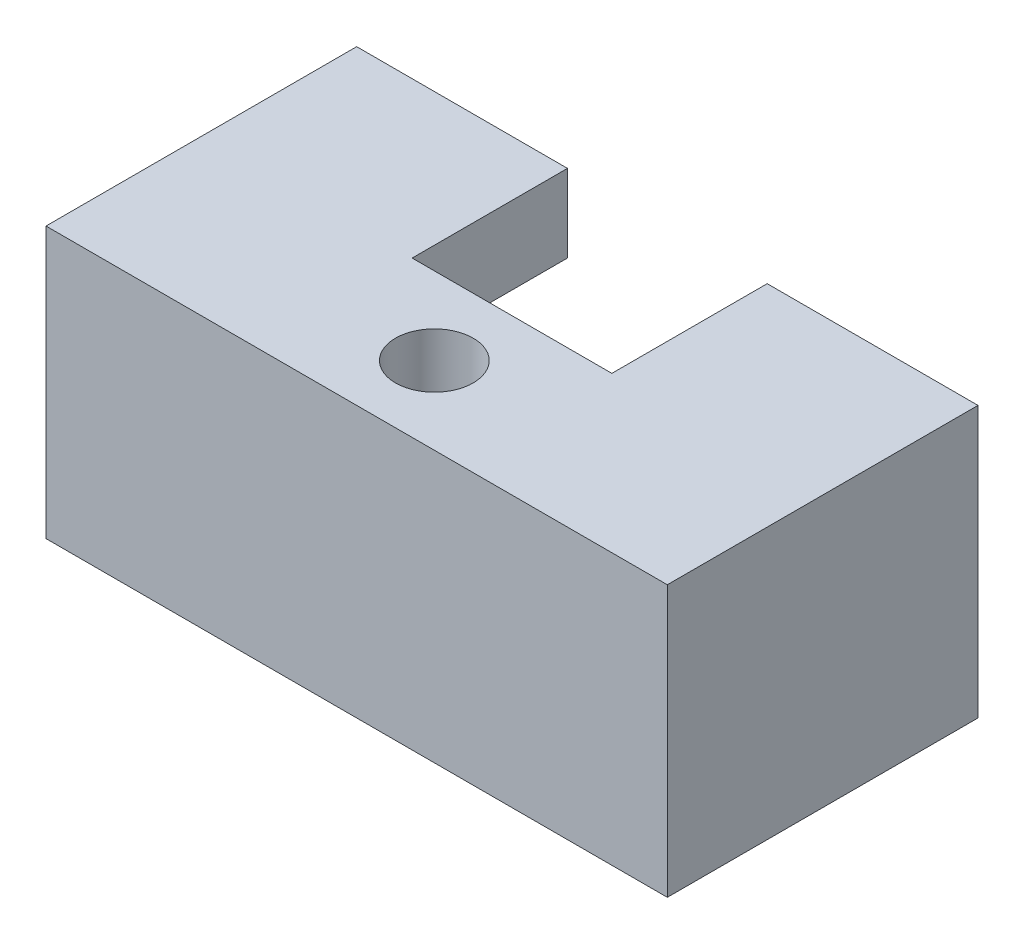
ISO-10303-21;
HEADER;
FILE_DESCRIPTION(('STEP AP214'),'2;1');
FILE_NAME('part.step','',(''),(''),'','','');
FILE_SCHEMA(('AUTOMOTIVE_DESIGN { 1 0 10303 214 1 1 1 1 }'));
ENDSEC;
DATA;
#1=APPLICATION_CONTEXT('core data for automotive mechanical design processes');
#2=APPLICATION_PROTOCOL_DEFINITION('international standard','automotive_design',2000,#1);
#3=PRODUCT_CONTEXT('',#1,'mechanical');
#4=PRODUCT('Part','Part','',(#3));
#5=PRODUCT_RELATED_PRODUCT_CATEGORY('part','',(#4));
#6=PRODUCT_DEFINITION_FORMATION('','',#4);
#7=PRODUCT_DEFINITION_CONTEXT('part definition',#1,'design');
#8=PRODUCT_DEFINITION('design','',#6,#7);
#9=PRODUCT_DEFINITION_SHAPE('','',#8);
#10=(LENGTH_UNIT() NAMED_UNIT(*) SI_UNIT(.MILLI.,.METRE.));
#11=(NAMED_UNIT(*) PLANE_ANGLE_UNIT() SI_UNIT($,.RADIAN.));
#12=(NAMED_UNIT(*) SI_UNIT($,.STERADIAN.) SOLID_ANGLE_UNIT());
#13=UNCERTAINTY_MEASURE_WITH_UNIT(LENGTH_MEASURE(1.E-05),#10,'distance_accuracy_value','');
#14=(GEOMETRIC_REPRESENTATION_CONTEXT(3) GLOBAL_UNCERTAINTY_ASSIGNED_CONTEXT((#13)) GLOBAL_UNIT_ASSIGNED_CONTEXT((#10,
#11,#12)) REPRESENTATION_CONTEXT('',''));
#15=CARTESIAN_POINT('',(0.,0.,0.));
#16=DIRECTION('',(0.,0.,1.));
#17=DIRECTION('',(1.,0.,0.));
#18=AXIS2_PLACEMENT_3D('',#15,#16,#17);
#19=CARTESIAN_POINT('',(9.25,8.7,0.));
#20=DIRECTION('',(-1.,0.,0.));
#21=DIRECTION('',(0.,0.,1.));
#22=AXIS2_PLACEMENT_3D('',#19,#20,#21);
#23=PLANE('',#22);
#24=DIRECTION('',(0.,0.,-1.));
#25=VECTOR('',#24,1.);
#26=CARTESIAN_POINT('',(9.25,0.,0.));
#27=LINE('',#26,#25);
#28=CARTESIAN_POINT('',(9.25,0.,0.));
#29=VERTEX_POINT('',#28);
#30=CARTESIAN_POINT('',(9.25,0.,-7.));
#31=VERTEX_POINT('',#30);
#32=EDGE_CURVE('E140',#29,#31,#27,.T.);
#33=ORIENTED_EDGE('',*,*,#32,.F.);
#34=DIRECTION('',(0.,-1.,0.));
#35=VECTOR('',#34,1.);
#36=CARTESIAN_POINT('',(9.25,8.7,0.));
#37=LINE('',#36,#35);
#38=CARTESIAN_POINT('',(9.25,8.7,0.));
#39=VERTEX_POINT('',#38);
#40=EDGE_CURVE('E12',#39,#29,#37,.T.);
#41=ORIENTED_EDGE('',*,*,#40,.F.);
#42=DIRECTION('',(0.,0.,-1.));
#43=VECTOR('',#42,1.);
#44=CARTESIAN_POINT('',(9.25,8.7,0.));
#45=LINE('',#44,#43);
#46=CARTESIAN_POINT('',(9.25,8.7,-7.));
#47=VERTEX_POINT('',#46);
#48=EDGE_CURVE('E141',#39,#47,#45,.T.);
#49=ORIENTED_EDGE('',*,*,#48,.T.);
#50=DIRECTION('',(0.,-1.,0.));
#51=VECTOR('',#50,1.);
#52=CARTESIAN_POINT('',(9.25,8.7,-7.));
#53=LINE('',#52,#51);
#54=EDGE_CURVE('E125',#47,#31,#53,.T.);
#55=ORIENTED_EDGE('',*,*,#54,.T.);
#56=EDGE_LOOP('',(#33,#41,#49,#55));
#57=FACE_BOUND('',#56,.T.);
#58=ADVANCED_FACE('F66',(#57),#23,.T.);
#59=CARTESIAN_POINT('',(0.,8.7,0.));
#60=DIRECTION('',(0.,0.,-1.));
#61=DIRECTION('',(-1.,0.,0.));
#62=AXIS2_PLACEMENT_3D('',#59,#60,#61);
#63=PLANE('',#62);
#64=DIRECTION('',(1.,0.,0.));
#65=VECTOR('',#64,1.);
#66=CARTESIAN_POINT('',(0.,0.,0.));
#67=LINE('',#66,#65);
#68=CARTESIAN_POINT('',(-9.25,0.,0.));
#69=VERTEX_POINT('',#68);
#70=EDGE_CURVE('E166',#69,#29,#67,.T.);
#71=ORIENTED_EDGE('',*,*,#70,.F.);
#72=DIRECTION('',(0.,-1.,0.));
#73=VECTOR('',#72,1.);
#74=CARTESIAN_POINT('',(-9.25,8.7,0.));
#75=LINE('',#74,#73);
#76=CARTESIAN_POINT('',(-9.25,8.7,0.));
#77=VERTEX_POINT('',#76);
#78=EDGE_CURVE('E75',#77,#69,#75,.T.);
#79=ORIENTED_EDGE('',*,*,#78,.F.);
#80=DIRECTION('',(1.,0.,0.));
#81=VECTOR('',#80,1.);
#82=CARTESIAN_POINT('',(0.,8.7,0.));
#83=LINE('',#82,#81);
#84=CARTESIAN_POINT('',(-4.5,8.7,0.));
#85=VERTEX_POINT('',#84);
#86=EDGE_CURVE('E82',#77,#85,#83,.T.);
#87=ORIENTED_EDGE('',*,*,#86,.T.);
#88=DIRECTION('',(0.,-1.,0.));
#89=VECTOR('',#88,1.);
#90=CARTESIAN_POINT('',(-4.5,12.2,0.));
#91=LINE('',#90,#89);
#92=CARTESIAN_POINT('',(-4.5,12.2,0.));
#93=VERTEX_POINT('',#92);
#94=EDGE_CURVE('E271',#93,#85,#91,.T.);
#95=ORIENTED_EDGE('',*,*,#94,.F.);
#96=DIRECTION('',(-1.,0.,0.));
#97=VECTOR('',#96,1.);
#98=CARTESIAN_POINT('',(0.,12.2,0.));
#99=LINE('',#98,#97);
#100=CARTESIAN_POINT('',(4.5,12.2,0.));
#101=VERTEX_POINT('',#100);
#102=EDGE_CURVE('E254',#101,#93,#99,.T.);
#103=ORIENTED_EDGE('',*,*,#102,.F.);
#104=DIRECTION('',(0.,-1.,0.));
#105=VECTOR('',#104,1.);
#106=CARTESIAN_POINT('',(4.5,12.2,0.));
#107=LINE('',#106,#105);
#108=CARTESIAN_POINT('',(4.5,8.7,0.));
#109=VERTEX_POINT('',#108);
#110=EDGE_CURVE('E249',#101,#109,#107,.T.);
#111=ORIENTED_EDGE('',*,*,#110,.T.);
#112=EDGE_CURVE('E144',#109,#39,#83,.T.);
#113=ORIENTED_EDGE('',*,*,#112,.T.);
#114=ORIENTED_EDGE('',*,*,#40,.T.);
#115=EDGE_LOOP('',(#71,#79,#87,#95,#103,#111,#113,#114));
#116=FACE_BOUND('',#115,.T.);
#117=ADVANCED_FACE('F167',(#116),#63,.T.);
#118=CARTESIAN_POINT('',(-9.25,8.7,0.));
#119=DIRECTION('',(1.,0.,0.));
#120=DIRECTION('',(0.,0.,-1.));
#121=AXIS2_PLACEMENT_3D('',#118,#119,#120);
#122=PLANE('',#121);
#123=DIRECTION('',(0.,0.,1.));
#124=VECTOR('',#123,1.);
#125=CARTESIAN_POINT('',(-9.25,0.,0.));
#126=LINE('',#125,#124);
#127=CARTESIAN_POINT('',(-9.25,0.,-6.99999999999999));
#128=VERTEX_POINT('',#127);
#129=EDGE_CURVE('E163',#128,#69,#126,.T.);
#130=ORIENTED_EDGE('',*,*,#129,.F.);
#131=DIRECTION('',(0.,-1.,0.));
#132=VECTOR('',#131,1.);
#133=CARTESIAN_POINT('',(-9.25,8.7,-6.99999999999999));
#134=LINE('',#133,#132);
#135=CARTESIAN_POINT('',(-9.25,8.7,-6.99999999999999));
#136=VERTEX_POINT('',#135);
#137=EDGE_CURVE('E155',#136,#128,#134,.T.);
#138=ORIENTED_EDGE('',*,*,#137,.F.);
#139=DIRECTION('',(0.,0.,1.));
#140=VECTOR('',#139,1.);
#141=CARTESIAN_POINT('',(-9.25,8.7,0.));
#142=LINE('',#141,#140);
#143=EDGE_CURVE('E148',#136,#77,#142,.T.);
#144=ORIENTED_EDGE('',*,*,#143,.T.);
#145=ORIENTED_EDGE('',*,*,#78,.T.);
#146=EDGE_LOOP('',(#130,#138,#144,#145));
#147=FACE_BOUND('',#146,.T.);
#148=ADVANCED_FACE('F160',(#147),#122,.T.);
#149=CARTESIAN_POINT('',(0.,8.7,-6.99999999999999));
#150=DIRECTION('',(0.,0.,-1.));
#151=DIRECTION('',(-1.,0.,0.));
#152=AXIS2_PLACEMENT_3D('',#149,#150,#151);
#153=PLANE('',#152);
#154=DIRECTION('',(1.,0.,0.));
#155=VECTOR('',#154,1.);
#156=CARTESIAN_POINT('',(0.,0.,-6.99999999999999));
#157=LINE('',#156,#155);
#158=CARTESIAN_POINT('',(-14.,0.,-6.99999999999999));
#159=VERTEX_POINT('',#158);
#160=EDGE_CURVE('E173',#159,#128,#157,.T.);
#161=ORIENTED_EDGE('',*,*,#160,.F.);
#162=DIRECTION('',(0.,-1.,0.));
#163=VECTOR('',#162,1.);
#164=CARTESIAN_POINT('',(-14.,8.7,-6.99999999999999));
#165=LINE('',#164,#163);
#166=CARTESIAN_POINT('',(-14.,12.2,-6.99999999999999));
#167=VERTEX_POINT('',#166);
#168=EDGE_CURVE('E153',#167,#159,#165,.T.);
#169=ORIENTED_EDGE('',*,*,#168,.F.);
#170=DIRECTION('',(-1.,0.,0.));
#171=VECTOR('',#170,1.);
#172=CARTESIAN_POINT('',(0.,12.2,-6.99999999999999));
#173=LINE('',#172,#171);
#174=CARTESIAN_POINT('',(-4.5,12.2,-6.99999999999999));
#175=VERTEX_POINT('',#174);
#176=EDGE_CURVE('E269',#175,#167,#173,.T.);
#177=ORIENTED_EDGE('',*,*,#176,.F.);
#178=DIRECTION('',(0.,-1.,0.));
#179=VECTOR('',#178,1.);
#180=CARTESIAN_POINT('',(-4.5,12.2,-6.99999999999999));
#181=LINE('',#180,#179);
#182=CARTESIAN_POINT('',(-4.5,8.7,-6.99999999999999));
#183=VERTEX_POINT('',#182);
#184=EDGE_CURVE('E261',#175,#183,#181,.T.);
#185=ORIENTED_EDGE('',*,*,#184,.T.);
#186=DIRECTION('',(-1.,0.,0.));
#187=VECTOR('',#186,1.);
#188=CARTESIAN_POINT('',(0.,8.7,-6.99999999999999));
#189=LINE('',#188,#187);
#190=EDGE_CURVE('E203',#183,#136,#189,.T.);
#191=ORIENTED_EDGE('',*,*,#190,.T.);
#192=ORIENTED_EDGE('',*,*,#137,.T.);
#193=EDGE_LOOP('',(#161,#169,#177,#185,#191,#192));
#194=FACE_BOUND('',#193,.T.);
#195=ADVANCED_FACE('F198',(#194),#153,.T.);
#196=CARTESIAN_POINT('',(-14.,8.7,0.));
#197=DIRECTION('',(-1.,0.,0.));
#198=DIRECTION('',(0.,0.,1.));
#199=AXIS2_PLACEMENT_3D('',#196,#197,#198);
#200=PLANE('',#199);
#201=DIRECTION('',(0.,0.,-1.));
#202=VECTOR('',#201,1.);
#203=CARTESIAN_POINT('',(-14.,0.,0.));
#204=LINE('',#203,#202);
#205=CARTESIAN_POINT('',(-14.,0.,7.00000000000001));
#206=VERTEX_POINT('',#205);
#207=EDGE_CURVE('E175',#206,#159,#204,.T.);
#208=ORIENTED_EDGE('',*,*,#207,.F.);
#209=DIRECTION('',(0.,-1.,0.));
#210=VECTOR('',#209,1.);
#211=CARTESIAN_POINT('',(-14.,8.7,7.00000000000001));
#212=LINE('',#211,#210);
#213=CARTESIAN_POINT('',(-14.,12.2,7.00000000000001));
#214=VERTEX_POINT('',#213);
#215=EDGE_CURVE('E151',#214,#206,#212,.T.);
#216=ORIENTED_EDGE('',*,*,#215,.F.);
#217=DIRECTION('',(0.,0.,1.));
#218=VECTOR('',#217,1.);
#219=CARTESIAN_POINT('',(-14.,12.2,0.));
#220=LINE('',#219,#218);
#221=EDGE_CURVE('E194',#167,#214,#220,.T.);
#222=ORIENTED_EDGE('',*,*,#221,.F.);
#223=ORIENTED_EDGE('',*,*,#168,.T.);
#224=EDGE_LOOP('',(#208,#216,#222,#223));
#225=FACE_BOUND('',#224,.T.);
#226=ADVANCED_FACE('F191',(#225),#200,.T.);
#227=CARTESIAN_POINT('',(0.,8.7,7.));
#228=DIRECTION('',(0.,0.,1.));
#229=DIRECTION('',(1.,0.,0.));
#230=AXIS2_PLACEMENT_3D('',#227,#228,#229);
#231=PLANE('',#230);
#232=DIRECTION('',(-1.,0.,0.));
#233=VECTOR('',#232,1.);
#234=CARTESIAN_POINT('',(0.,0.,7.));
#235=LINE('',#234,#233);
#236=CARTESIAN_POINT('',(14.,0.,7.));
#237=VERTEX_POINT('',#236);
#238=EDGE_CURVE('E134',#237,#206,#235,.T.);
#239=ORIENTED_EDGE('',*,*,#238,.F.);
#240=DIRECTION('',(0.,-1.,0.));
#241=VECTOR('',#240,1.);
#242=CARTESIAN_POINT('',(14.,8.7,7.));
#243=LINE('',#242,#241);
#244=CARTESIAN_POINT('',(14.,12.2,7.));
#245=VERTEX_POINT('',#244);
#246=EDGE_CURVE('E124',#245,#237,#243,.T.);
#247=ORIENTED_EDGE('',*,*,#246,.F.);
#248=DIRECTION('',(1.,0.,0.));
#249=VECTOR('',#248,1.);
#250=CARTESIAN_POINT('',(0.,12.2,7.));
#251=LINE('',#250,#249);
#252=EDGE_CURVE('E187',#214,#245,#251,.T.);
#253=ORIENTED_EDGE('',*,*,#252,.F.);
#254=ORIENTED_EDGE('',*,*,#215,.T.);
#255=EDGE_LOOP('',(#239,#247,#253,#254));
#256=FACE_BOUND('',#255,.T.);
#257=ADVANCED_FACE('F181',(#256),#231,.T.);
#258=CARTESIAN_POINT('',(14.,8.7,0.));
#259=DIRECTION('',(1.,0.,0.));
#260=DIRECTION('',(0.,0.,-1.));
#261=AXIS2_PLACEMENT_3D('',#258,#259,#260);
#262=PLANE('',#261);
#263=DIRECTION('',(0.,0.,1.));
#264=VECTOR('',#263,1.);
#265=CARTESIAN_POINT('',(14.,0.,0.));
#266=LINE('',#265,#264);
#267=CARTESIAN_POINT('',(14.,0.,-7.));
#268=VERTEX_POINT('',#267);
#269=EDGE_CURVE('E128',#268,#237,#266,.T.);
#270=ORIENTED_EDGE('',*,*,#269,.F.);
#271=DIRECTION('',(0.,-1.,0.));
#272=VECTOR('',#271,1.);
#273=CARTESIAN_POINT('',(14.,8.7,-7.));
#274=LINE('',#273,#272);
#275=CARTESIAN_POINT('',(14.,12.2,-7.));
#276=VERTEX_POINT('',#275);
#277=EDGE_CURVE('E111',#276,#268,#274,.T.);
#278=ORIENTED_EDGE('',*,*,#277,.F.);
#279=DIRECTION('',(0.,0.,-1.));
#280=VECTOR('',#279,1.);
#281=CARTESIAN_POINT('',(14.,12.2,0.));
#282=LINE('',#281,#280);
#283=EDGE_CURVE('E240',#245,#276,#282,.T.);
#284=ORIENTED_EDGE('',*,*,#283,.F.);
#285=ORIENTED_EDGE('',*,*,#246,.T.);
#286=EDGE_LOOP('',(#270,#278,#284,#285));
#287=FACE_BOUND('',#286,.T.);
#288=ADVANCED_FACE('F129',(#287),#262,.T.);
#289=CARTESIAN_POINT('',(0.,8.7,3.5));
#290=DIRECTION('',(0.,-1.,0.));
#291=DIRECTION('',(0.,0.,-1.));
#292=AXIS2_PLACEMENT_3D('',#289,#290,#291);
#293=CYLINDRICAL_SURFACE('',#292,1.75);
#294=CARTESIAN_POINT('',(0.,0.,3.5));
#295=DIRECTION('',(0.,1.,0.));
#296=DIRECTION('',(0.,0.,1.));
#297=AXIS2_PLACEMENT_3D('',#294,#295,#296);
#298=CIRCLE('',#297,1.75);
#299=CARTESIAN_POINT('',(0.,0.,5.25));
#300=VERTEX_POINT('',#299);
#301=EDGE_CURVE('E248',#300,#300,#298,.T.);
#302=ORIENTED_EDGE('',*,*,#301,.F.);
#303=EDGE_LOOP('',(#302));
#304=FACE_BOUND('',#303,.T.);
#305=CARTESIAN_POINT('',(0.,12.2,3.5));
#306=DIRECTION('',(0.,1.,0.));
#307=DIRECTION('',(0.,0.,1.));
#308=AXIS2_PLACEMENT_3D('',#305,#306,#307);
#309=CIRCLE('',#308,1.75);
#310=CARTESIAN_POINT('',(0.,12.2,5.25));
#311=VERTEX_POINT('',#310);
#312=EDGE_CURVE('E263',#311,#311,#309,.T.);
#313=ORIENTED_EDGE('',*,*,#312,.T.);
#314=EDGE_LOOP('',(#313));
#315=FACE_BOUND('',#314,.T.);
#316=ADVANCED_FACE('F68',(#304,#315),#293,.F.);
#317=CARTESIAN_POINT('',(0.,8.7,-6.99999999999999));
#318=DIRECTION('',(0.,0.,-1.));
#319=DIRECTION('',(-1.,0.,0.));
#320=AXIS2_PLACEMENT_3D('',#317,#318,#319);
#321=PLANE('',#320);
#322=DIRECTION('',(1.,0.,0.));
#323=VECTOR('',#322,1.);
#324=CARTESIAN_POINT('',(0.,0.,-6.99999999999999));
#325=LINE('',#324,#323);
#326=EDGE_CURVE('E116',#31,#268,#325,.T.);
#327=ORIENTED_EDGE('',*,*,#326,.F.);
#328=ORIENTED_EDGE('',*,*,#54,.F.);
#329=DIRECTION('',(-1.,0.,0.));
#330=VECTOR('',#329,1.);
#331=CARTESIAN_POINT('',(0.,8.7,-6.99999999999999));
#332=LINE('',#331,#330);
#333=CARTESIAN_POINT('',(4.5,8.7,-6.99999999999999));
#334=VERTEX_POINT('',#333);
#335=EDGE_CURVE('E244',#47,#334,#332,.T.);
#336=ORIENTED_EDGE('',*,*,#335,.T.);
#337=DIRECTION('',(0.,-1.,0.));
#338=VECTOR('',#337,1.);
#339=CARTESIAN_POINT('',(4.5,12.2,-6.99999999999999));
#340=LINE('',#339,#338);
#341=CARTESIAN_POINT('',(4.5,12.2,-6.99999999999999));
#342=VERTEX_POINT('',#341);
#343=EDGE_CURVE('E243',#342,#334,#340,.T.);
#344=ORIENTED_EDGE('',*,*,#343,.F.);
#345=DIRECTION('',(-1.,0.,0.));
#346=VECTOR('',#345,1.);
#347=CARTESIAN_POINT('',(0.,12.2,-6.99999999999999));
#348=LINE('',#347,#346);
#349=EDGE_CURVE('E120',#276,#342,#348,.T.);
#350=ORIENTED_EDGE('',*,*,#349,.F.);
#351=ORIENTED_EDGE('',*,*,#277,.T.);
#352=EDGE_LOOP('',(#327,#328,#336,#344,#350,#351));
#353=FACE_BOUND('',#352,.T.);
#354=ADVANCED_FACE('F113',(#353),#321,.T.);
#355=CARTESIAN_POINT('',(0.,0.,0.));
#356=DIRECTION('',(0.,1.,0.));
#357=DIRECTION('',(0.,0.,1.));
#358=AXIS2_PLACEMENT_3D('',#355,#356,#357);
#359=PLANE('',#358);
#360=ORIENTED_EDGE('',*,*,#301,.T.);
#361=EDGE_LOOP('',(#360));
#362=FACE_BOUND('',#361,.T.);
#363=ORIENTED_EDGE('',*,*,#32,.T.);
#364=ORIENTED_EDGE('',*,*,#326,.T.);
#365=ORIENTED_EDGE('',*,*,#269,.T.);
#366=ORIENTED_EDGE('',*,*,#238,.T.);
#367=ORIENTED_EDGE('',*,*,#207,.T.);
#368=ORIENTED_EDGE('',*,*,#160,.T.);
#369=ORIENTED_EDGE('',*,*,#129,.T.);
#370=ORIENTED_EDGE('',*,*,#70,.T.);
#371=EDGE_LOOP('',(#363,#364,#365,#366,#367,#368,#369,#370));
#372=FACE_BOUND('',#371,.T.);
#373=ADVANCED_FACE('F137',(#362,#372),#359,.F.);
#374=CARTESIAN_POINT('',(0.,8.7,0.));
#375=DIRECTION('',(0.,1.,0.));
#376=DIRECTION('',(0.,0.,1.));
#377=AXIS2_PLACEMENT_3D('',#374,#375,#376);
#378=PLANE('',#377);
#379=ORIENTED_EDGE('',*,*,#48,.F.);
#380=ORIENTED_EDGE('',*,*,#112,.F.);
#381=DIRECTION('',(0.,0.,1.));
#382=VECTOR('',#381,1.);
#383=CARTESIAN_POINT('',(4.5,8.7,0.));
#384=LINE('',#383,#382);
#385=EDGE_CURVE('E265',#334,#109,#384,.T.);
#386=ORIENTED_EDGE('',*,*,#385,.F.);
#387=ORIENTED_EDGE('',*,*,#335,.F.);
#388=EDGE_LOOP('',(#379,#380,#386,#387));
#389=FACE_BOUND('',#388,.T.);
#390=ADVANCED_FACE('F321',(#389),#378,.F.);
#391=CARTESIAN_POINT('',(0.,12.2,0.));
#392=DIRECTION('',(0.,1.,0.));
#393=DIRECTION('',(0.,0.,1.));
#394=AXIS2_PLACEMENT_3D('',#391,#392,#393);
#395=PLANE('',#394);
#396=ORIENTED_EDGE('',*,*,#176,.T.);
#397=ORIENTED_EDGE('',*,*,#221,.T.);
#398=ORIENTED_EDGE('',*,*,#252,.T.);
#399=ORIENTED_EDGE('',*,*,#283,.T.);
#400=ORIENTED_EDGE('',*,*,#349,.T.);
#401=DIRECTION('',(0.,0.,1.));
#402=VECTOR('',#401,1.);
#403=CARTESIAN_POINT('',(4.5,12.2,0.));
#404=LINE('',#403,#402);
#405=EDGE_CURVE('E238',#342,#101,#404,.T.);
#406=ORIENTED_EDGE('',*,*,#405,.T.);
#407=ORIENTED_EDGE('',*,*,#102,.T.);
#408=DIRECTION('',(0.,0.,-1.));
#409=VECTOR('',#408,1.);
#410=CARTESIAN_POINT('',(-4.5,12.2,0.));
#411=LINE('',#410,#409);
#412=EDGE_CURVE('E256',#93,#175,#411,.T.);
#413=ORIENTED_EDGE('',*,*,#412,.T.);
#414=EDGE_LOOP('',(#396,#397,#398,#399,#400,#406,#407,#413));
#415=FACE_BOUND('',#414,.T.);
#416=ORIENTED_EDGE('',*,*,#312,.F.);
#417=EDGE_LOOP('',(#416));
#418=FACE_BOUND('',#417,.T.);
#419=ADVANCED_FACE('F235',(#415,#418),#395,.T.);
#420=ORIENTED_EDGE('',*,*,#86,.F.);
#421=ORIENTED_EDGE('',*,*,#143,.F.);
#422=ORIENTED_EDGE('',*,*,#190,.F.);
#423=DIRECTION('',(0.,0.,-1.));
#424=VECTOR('',#423,1.);
#425=CARTESIAN_POINT('',(-4.5,8.7,0.));
#426=LINE('',#425,#424);
#427=EDGE_CURVE('E267',#85,#183,#426,.T.);
#428=ORIENTED_EDGE('',*,*,#427,.F.);
#429=EDGE_LOOP('',(#420,#421,#422,#428));
#430=FACE_BOUND('',#429,.T.);
#431=ADVANCED_FACE('F291',(#430),#378,.F.);
#432=CARTESIAN_POINT('',(4.5,12.2,0.));
#433=DIRECTION('',(1.,0.,0.));
#434=DIRECTION('',(0.,0.,-1.));
#435=AXIS2_PLACEMENT_3D('',#432,#433,#434);
#436=PLANE('',#435);
#437=ORIENTED_EDGE('',*,*,#385,.T.);
#438=ORIENTED_EDGE('',*,*,#110,.F.);
#439=ORIENTED_EDGE('',*,*,#405,.F.);
#440=ORIENTED_EDGE('',*,*,#343,.T.);
#441=EDGE_LOOP('',(#437,#438,#439,#440));
#442=FACE_BOUND('',#441,.T.);
#443=ADVANCED_FACE('F251',(#442),#436,.F.);
#444=CARTESIAN_POINT('',(-4.5,12.2,0.));
#445=DIRECTION('',(-1.,0.,0.));
#446=DIRECTION('',(0.,0.,1.));
#447=AXIS2_PLACEMENT_3D('',#444,#445,#446);
#448=PLANE('',#447);
#449=ORIENTED_EDGE('',*,*,#427,.T.);
#450=ORIENTED_EDGE('',*,*,#184,.F.);
#451=ORIENTED_EDGE('',*,*,#412,.F.);
#452=ORIENTED_EDGE('',*,*,#94,.T.);
#453=EDGE_LOOP('',(#449,#450,#451,#452));
#454=FACE_BOUND('',#453,.T.);
#455=ADVANCED_FACE('F293',(#454),#448,.F.);
#456=CLOSED_SHELL('',(#58,#117,#148,#195,#226,#257,#288,#316,#354,#373,#390,#419,#431,#443,#455));
#457=MANIFOLD_SOLID_BREP('B2',#456);
#458=ADVANCED_BREP_SHAPE_REPRESENTATION('',(#18,#457),#14);
#459=SHAPE_DEFINITION_REPRESENTATION(#9,#458);
ENDSEC;
END-ISO-10303-21;
